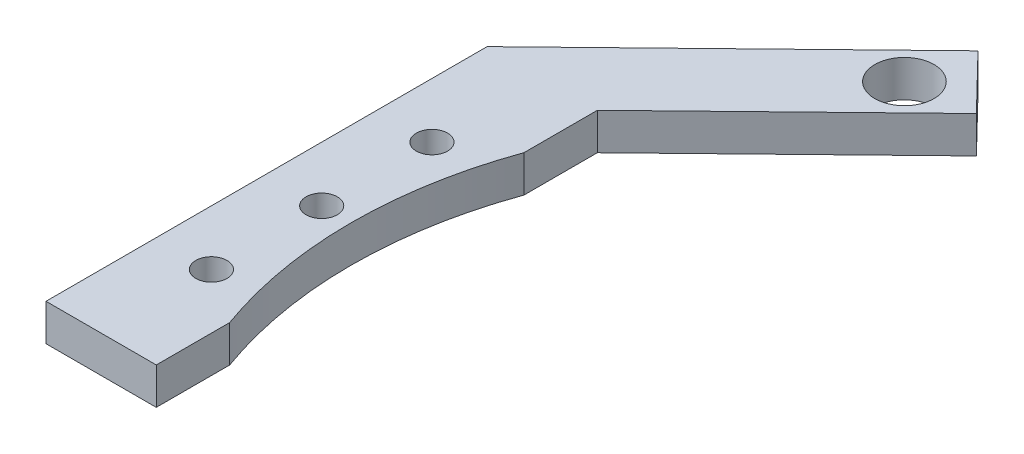
ISO-10303-21;
HEADER;
FILE_DESCRIPTION(('STEP AP214'),'2;1');
FILE_NAME('part.step','',(''),(''),'','','');
FILE_SCHEMA(('AUTOMOTIVE_DESIGN { 1 0 10303 214 1 1 1 1 }'));
ENDSEC;
DATA;
#1=APPLICATION_CONTEXT('core data for automotive mechanical design processes');
#2=APPLICATION_PROTOCOL_DEFINITION('international standard','automotive_design',2000,#1);
#3=PRODUCT_CONTEXT('',#1,'mechanical');
#4=PRODUCT('Part','Part','',(#3));
#5=PRODUCT_RELATED_PRODUCT_CATEGORY('part','',(#4));
#6=PRODUCT_DEFINITION_FORMATION('','',#4);
#7=PRODUCT_DEFINITION_CONTEXT('part definition',#1,'design');
#8=PRODUCT_DEFINITION('design','',#6,#7);
#9=PRODUCT_DEFINITION_SHAPE('','',#8);
#10=(LENGTH_UNIT() NAMED_UNIT(*) SI_UNIT(.MILLI.,.METRE.));
#11=(NAMED_UNIT(*) PLANE_ANGLE_UNIT() SI_UNIT($,.RADIAN.));
#12=(NAMED_UNIT(*) SI_UNIT($,.STERADIAN.) SOLID_ANGLE_UNIT());
#13=UNCERTAINTY_MEASURE_WITH_UNIT(LENGTH_MEASURE(1.E-05),#10,'distance_accuracy_value','');
#14=(GEOMETRIC_REPRESENTATION_CONTEXT(3) GLOBAL_UNCERTAINTY_ASSIGNED_CONTEXT((#13)) GLOBAL_UNIT_ASSIGNED_CONTEXT((#10,
#11,#12)) REPRESENTATION_CONTEXT('',''));
#15=CARTESIAN_POINT('',(0.,0.,0.));
#16=DIRECTION('',(0.,0.,1.));
#17=DIRECTION('',(1.,0.,0.));
#18=AXIS2_PLACEMENT_3D('',#15,#16,#17);
#19=CARTESIAN_POINT('',(-55.5,2.5,-30.));
#20=DIRECTION('',(-1.,0.,0.));
#21=DIRECTION('',(0.,0.,1.));
#22=AXIS2_PLACEMENT_3D('',#19,#20,#21);
#23=PLANE('',#22);
#24=DIRECTION('',(0.,0.,-1.));
#25=VECTOR('',#24,1.);
#26=CARTESIAN_POINT('',(-55.5,-2.5,-30.));
#27=LINE('',#26,#25);
#28=CARTESIAN_POINT('',(-55.5,-2.5,30.));
#29=VERTEX_POINT('',#28);
#30=CARTESIAN_POINT('',(-55.5,-2.5,20.0187412191676));
#31=VERTEX_POINT('',#30);
#32=EDGE_CURVE('E143',#29,#31,#27,.T.);
#33=ORIENTED_EDGE('',*,*,#32,.T.);
#34=DIRECTION('',(0.,1.,0.));
#35=VECTOR('',#34,1.);
#36=CARTESIAN_POINT('',(-55.5,-2.5,20.0187412191676));
#37=LINE('',#36,#35);
#38=CARTESIAN_POINT('',(-55.5,2.5,20.0187412191676));
#39=VERTEX_POINT('',#38);
#40=EDGE_CURVE('E11',#31,#39,#37,.T.);
#41=ORIENTED_EDGE('',*,*,#40,.T.);
#42=DIRECTION('',(0.,0.,-1.));
#43=VECTOR('',#42,1.);
#44=CARTESIAN_POINT('',(-55.5,2.5,-30.));
#45=LINE('',#44,#43);
#46=CARTESIAN_POINT('',(-55.5,2.5,30.));
#47=VERTEX_POINT('',#46);
#48=EDGE_CURVE('E118',#47,#39,#45,.T.);
#49=ORIENTED_EDGE('',*,*,#48,.F.);
#50=DIRECTION('',(0.,-1.,0.));
#51=VECTOR('',#50,1.);
#52=CARTESIAN_POINT('',(-55.5,2.5,30.));
#53=LINE('',#52,#51);
#54=EDGE_CURVE('E154',#47,#29,#53,.T.);
#55=ORIENTED_EDGE('',*,*,#54,.T.);
#56=EDGE_LOOP('',(#33,#41,#49,#55));
#57=FACE_BOUND('',#56,.T.);
#58=ADVANCED_FACE('F35',(#57),#23,.F.);
#59=CARTESIAN_POINT('',(0.,2.5,0.));
#60=DIRECTION('',(0.,-1.,0.));
#61=DIRECTION('',(0.,0.,-1.));
#62=AXIS2_PLACEMENT_3D('',#59,#60,#61);
#63=PLANE('',#62);
#64=ORIENTED_EDGE('',*,*,#48,.T.);
#65=CARTESIAN_POINT('',(0.,2.5,0.));
#66=DIRECTION('',(0.,1.,0.));
#67=DIRECTION('',(0.,0.,1.));
#68=AXIS2_PLACEMENT_3D('',#65,#66,#67);
#69=CIRCLE('',#68,59.);
#70=CARTESIAN_POINT('',(-55.5,2.5,-20.0187412191676));
#71=VERTEX_POINT('',#70);
#72=EDGE_CURVE('E179',#71,#39,#69,.T.);
#73=ORIENTED_EDGE('',*,*,#72,.F.);
#74=CARTESIAN_POINT('',(-55.5,2.5,-30.));
#75=VERTEX_POINT('',#74);
#76=EDGE_CURVE('E114',#71,#75,#45,.T.);
#77=ORIENTED_EDGE('',*,*,#76,.T.);
#78=DIRECTION('',(0.717529446727856,0.,-0.696528171058728));
#79=VECTOR('',#78,1.);
#80=CARTESIAN_POINT('',(-29.3380965830736,2.5,-55.3961740824809));
#81=LINE('',#80,#79);
#82=CARTESIAN_POINT('',(-29.3380965830736,2.5,-55.3961740824809));
#83=VERTEX_POINT('',#82);
#84=EDGE_CURVE('E104',#75,#83,#81,.T.);
#85=ORIENTED_EDGE('',*,*,#84,.T.);
#86=DIRECTION('',(-0.696528171058728,0.,-0.717529446727856));
#87=VECTOR('',#86,1.);
#88=CARTESIAN_POINT('',(-36.6153689792499,2.5,-62.8928661806329));
#89=LINE('',#88,#87);
#90=CARTESIAN_POINT('',(-36.6153689792499,2.5,-62.8928661806329));
#91=VERTEX_POINT('',#90);
#92=EDGE_CURVE('E110',#83,#91,#89,.T.);
#93=ORIENTED_EDGE('',*,*,#92,.T.);
#94=DIRECTION('',(-0.717529446727856,0.,0.696528171058728));
#95=VECTOR('',#94,1.);
#96=CARTESIAN_POINT('',(-70.5,2.5,-30.));
#97=LINE('',#96,#95);
#98=CARTESIAN_POINT('',(-70.5,2.5,-30.));
#99=VERTEX_POINT('',#98);
#100=EDGE_CURVE('E59',#91,#99,#97,.T.);
#101=ORIENTED_EDGE('',*,*,#100,.T.);
#102=DIRECTION('',(0.,0.,1.));
#103=VECTOR('',#102,1.);
#104=CARTESIAN_POINT('',(-70.5,2.5,-30.));
#105=LINE('',#104,#103);
#106=CARTESIAN_POINT('',(-70.5,2.5,30.));
#107=VERTEX_POINT('',#106);
#108=EDGE_CURVE('E150',#99,#107,#105,.T.);
#109=ORIENTED_EDGE('',*,*,#108,.T.);
#110=DIRECTION('',(1.,0.,0.));
#111=VECTOR('',#110,1.);
#112=CARTESIAN_POINT('',(-55.5,2.5,30.));
#113=LINE('',#112,#111);
#114=EDGE_CURVE('E95',#107,#47,#113,.T.);
#115=ORIENTED_EDGE('',*,*,#114,.T.);
#116=EDGE_LOOP('',(#64,#73,#77,#85,#93,#101,#109,#115));
#117=FACE_BOUND('',#116,.T.);
#118=CARTESIAN_POINT('',(-63.,2.5,0.));
#119=DIRECTION('',(0.,1.,0.));
#120=DIRECTION('',(0.,0.,1.));
#121=AXIS2_PLACEMENT_3D('',#118,#119,#120);
#122=CIRCLE('',#121,2.125);
#123=CARTESIAN_POINT('',(-63.,2.5,2.12500000000001));
#124=VERTEX_POINT('',#123);
#125=EDGE_CURVE('E140',#124,#124,#122,.T.);
#126=ORIENTED_EDGE('',*,*,#125,.F.);
#127=EDGE_LOOP('',(#126));
#128=FACE_BOUND('',#127,.T.);
#129=CARTESIAN_POINT('',(-63.,2.5,15.));
#130=DIRECTION('',(0.,1.,0.));
#131=DIRECTION('',(0.,0.,1.));
#132=AXIS2_PLACEMENT_3D('',#129,#130,#131);
#133=CIRCLE('',#132,2.125);
#134=CARTESIAN_POINT('',(-63.,2.5,17.125));
#135=VERTEX_POINT('',#134);
#136=EDGE_CURVE('E198',#135,#135,#133,.T.);
#137=ORIENTED_EDGE('',*,*,#136,.F.);
#138=EDGE_LOOP('',(#137));
#139=FACE_BOUND('',#138,.T.);
#140=CARTESIAN_POINT('',(-37.9994389082567,2.5,-54.2688229341458));
#141=DIRECTION('',(0.,1.,0.));
#142=DIRECTION('',(0.,0.,1.));
#143=AXIS2_PLACEMENT_3D('',#140,#141,#142);
#144=CIRCLE('',#143,4.025);
#145=CARTESIAN_POINT('',(-37.9994389082567,2.5,-50.2438229341458));
#146=VERTEX_POINT('',#145);
#147=EDGE_CURVE('E192',#146,#146,#144,.T.);
#148=ORIENTED_EDGE('',*,*,#147,.F.);
#149=EDGE_LOOP('',(#148));
#150=FACE_BOUND('',#149,.T.);
#151=CARTESIAN_POINT('',(-63.,2.5,-15.));
#152=DIRECTION('',(0.,1.,0.));
#153=DIRECTION('',(0.,0.,1.));
#154=AXIS2_PLACEMENT_3D('',#151,#152,#153);
#155=CIRCLE('',#154,2.125);
#156=CARTESIAN_POINT('',(-63.,2.5,-12.875));
#157=VERTEX_POINT('',#156);
#158=EDGE_CURVE('E186',#157,#157,#155,.T.);
#159=ORIENTED_EDGE('',*,*,#158,.F.);
#160=EDGE_LOOP('',(#159));
#161=FACE_BOUND('',#160,.T.);
#162=ADVANCED_FACE('F107',(#117,#128,#139,#150,#161),#63,.F.);
#163=CARTESIAN_POINT('',(0.,-2.5,0.));
#164=DIRECTION('',(0.,-1.,0.));
#165=DIRECTION('',(0.,0.,-1.));
#166=AXIS2_PLACEMENT_3D('',#163,#164,#165);
#167=PLANE('',#166);
#168=CARTESIAN_POINT('',(0.,-2.5,0.));
#169=DIRECTION('',(0.,1.,0.));
#170=DIRECTION('',(0.,0.,1.));
#171=AXIS2_PLACEMENT_3D('',#168,#169,#170);
#172=CIRCLE('',#171,59.);
#173=CARTESIAN_POINT('',(-55.5,-2.5,-20.0187412191676));
#174=VERTEX_POINT('',#173);
#175=EDGE_CURVE('E50',#174,#31,#172,.T.);
#176=ORIENTED_EDGE('',*,*,#175,.T.);
#177=ORIENTED_EDGE('',*,*,#32,.F.);
#178=DIRECTION('',(1.,0.,0.));
#179=VECTOR('',#178,1.);
#180=CARTESIAN_POINT('',(-55.5,-2.5,30.));
#181=LINE('',#180,#179);
#182=CARTESIAN_POINT('',(-70.5,-2.5,30.));
#183=VERTEX_POINT('',#182);
#184=EDGE_CURVE('E139',#183,#29,#181,.T.);
#185=ORIENTED_EDGE('',*,*,#184,.F.);
#186=DIRECTION('',(0.,0.,1.));
#187=VECTOR('',#186,1.);
#188=CARTESIAN_POINT('',(-70.5,-2.5,-30.));
#189=LINE('',#188,#187);
#190=CARTESIAN_POINT('',(-70.5,-2.5,-30.));
#191=VERTEX_POINT('',#190);
#192=EDGE_CURVE('E136',#191,#183,#189,.T.);
#193=ORIENTED_EDGE('',*,*,#192,.F.);
#194=DIRECTION('',(-0.717529446727856,0.,0.696528171058728));
#195=VECTOR('',#194,1.);
#196=CARTESIAN_POINT('',(-70.5,-2.5,-30.));
#197=LINE('',#196,#195);
#198=CARTESIAN_POINT('',(-36.6153689792499,-2.5,-62.8928661806329));
#199=VERTEX_POINT('',#198);
#200=EDGE_CURVE('E86',#199,#191,#197,.T.);
#201=ORIENTED_EDGE('',*,*,#200,.F.);
#202=DIRECTION('',(-0.696528171058728,0.,-0.717529446727856));
#203=VECTOR('',#202,1.);
#204=CARTESIAN_POINT('',(-36.6153689792499,-2.5,-62.8928661806329));
#205=LINE('',#204,#203);
#206=CARTESIAN_POINT('',(-29.3380965830736,-2.5,-55.3961740824809));
#207=VERTEX_POINT('',#206);
#208=EDGE_CURVE('E147',#207,#199,#205,.T.);
#209=ORIENTED_EDGE('',*,*,#208,.F.);
#210=DIRECTION('',(0.717529446727856,0.,-0.696528171058728));
#211=VECTOR('',#210,1.);
#212=CARTESIAN_POINT('',(-29.3380965830736,-2.5,-55.3961740824809));
#213=LINE('',#212,#211);
#214=CARTESIAN_POINT('',(-55.5,-2.5,-30.));
#215=VERTEX_POINT('',#214);
#216=EDGE_CURVE('E124',#215,#207,#213,.T.);
#217=ORIENTED_EDGE('',*,*,#216,.F.);
#218=EDGE_CURVE('E142',#174,#215,#27,.T.);
#219=ORIENTED_EDGE('',*,*,#218,.F.);
#220=EDGE_LOOP('',(#176,#177,#185,#193,#201,#209,#217,#219));
#221=FACE_BOUND('',#220,.T.);
#222=CARTESIAN_POINT('',(-37.9994389082567,-2.5,-54.2688229341458));
#223=DIRECTION('',(0.,1.,0.));
#224=DIRECTION('',(0.,0.,1.));
#225=AXIS2_PLACEMENT_3D('',#222,#223,#224);
#226=CIRCLE('',#225,4.025);
#227=CARTESIAN_POINT('',(-37.9994389082567,-2.5,-50.2438229341458));
#228=VERTEX_POINT('',#227);
#229=EDGE_CURVE('E189',#228,#228,#226,.T.);
#230=ORIENTED_EDGE('',*,*,#229,.T.);
#231=EDGE_LOOP('',(#230));
#232=FACE_BOUND('',#231,.T.);
#233=CARTESIAN_POINT('',(-63.,-2.5,0.));
#234=DIRECTION('',(0.,1.,0.));
#235=DIRECTION('',(0.,0.,1.));
#236=AXIS2_PLACEMENT_3D('',#233,#234,#235);
#237=CIRCLE('',#236,2.125);
#238=CARTESIAN_POINT('',(-63.,-2.5,2.12500000000001));
#239=VERTEX_POINT('',#238);
#240=EDGE_CURVE('E175',#239,#239,#237,.T.);
#241=ORIENTED_EDGE('',*,*,#240,.T.);
#242=EDGE_LOOP('',(#241));
#243=FACE_BOUND('',#242,.T.);
#244=CARTESIAN_POINT('',(-63.,-2.5,15.));
#245=DIRECTION('',(0.,1.,0.));
#246=DIRECTION('',(0.,0.,1.));
#247=AXIS2_PLACEMENT_3D('',#244,#245,#246);
#248=CIRCLE('',#247,2.125);
#249=CARTESIAN_POINT('',(-63.,-2.5,17.125));
#250=VERTEX_POINT('',#249);
#251=EDGE_CURVE('E195',#250,#250,#248,.T.);
#252=ORIENTED_EDGE('',*,*,#251,.T.);
#253=EDGE_LOOP('',(#252));
#254=FACE_BOUND('',#253,.T.);
#255=CARTESIAN_POINT('',(-63.,-2.5,-15.));
#256=DIRECTION('',(0.,1.,0.));
#257=DIRECTION('',(0.,0.,1.));
#258=AXIS2_PLACEMENT_3D('',#255,#256,#257);
#259=CIRCLE('',#258,2.125);
#260=CARTESIAN_POINT('',(-63.,-2.5,-12.875));
#261=VERTEX_POINT('',#260);
#262=EDGE_CURVE('E183',#261,#261,#259,.T.);
#263=ORIENTED_EDGE('',*,*,#262,.T.);
#264=EDGE_LOOP('',(#263));
#265=FACE_BOUND('',#264,.T.);
#266=ADVANCED_FACE('F164',(#221,#232,#243,#254,#265),#167,.T.);
#267=CARTESIAN_POINT('',(-70.5,2.5,-30.));
#268=DIRECTION('',(1.,0.,0.));
#269=DIRECTION('',(0.,0.,-1.));
#270=AXIS2_PLACEMENT_3D('',#267,#268,#269);
#271=PLANE('',#270);
#272=ORIENTED_EDGE('',*,*,#192,.T.);
#273=DIRECTION('',(0.,-1.,0.));
#274=VECTOR('',#273,1.);
#275=CARTESIAN_POINT('',(-70.5,2.5,30.));
#276=LINE('',#275,#274);
#277=EDGE_CURVE('E157',#107,#183,#276,.T.);
#278=ORIENTED_EDGE('',*,*,#277,.F.);
#279=ORIENTED_EDGE('',*,*,#108,.F.);
#280=DIRECTION('',(0.,-1.,0.));
#281=VECTOR('',#280,1.);
#282=CARTESIAN_POINT('',(-70.5,2.5,-30.));
#283=LINE('',#282,#281);
#284=EDGE_CURVE('E132',#99,#191,#283,.T.);
#285=ORIENTED_EDGE('',*,*,#284,.T.);
#286=EDGE_LOOP('',(#272,#278,#279,#285));
#287=FACE_BOUND('',#286,.T.);
#288=ADVANCED_FACE('F37',(#287),#271,.F.);
#289=CARTESIAN_POINT('',(-55.5,2.5,30.));
#290=DIRECTION('',(0.,0.,-1.));
#291=DIRECTION('',(-1.,0.,0.));
#292=AXIS2_PLACEMENT_3D('',#289,#290,#291);
#293=PLANE('',#292);
#294=ORIENTED_EDGE('',*,*,#184,.T.);
#295=ORIENTED_EDGE('',*,*,#54,.F.);
#296=ORIENTED_EDGE('',*,*,#114,.F.);
#297=ORIENTED_EDGE('',*,*,#277,.T.);
#298=EDGE_LOOP('',(#294,#295,#296,#297));
#299=FACE_BOUND('',#298,.T.);
#300=ADVANCED_FACE('F230',(#299),#293,.F.);
#301=ORIENTED_EDGE('',*,*,#76,.F.);
#302=DIRECTION('',(0.,1.,0.));
#303=VECTOR('',#302,1.);
#304=CARTESIAN_POINT('',(-55.5,-2.5,-20.0187412191676));
#305=LINE('',#304,#303);
#306=EDGE_CURVE('E43',#71,#174,#305,.F.);
#307=ORIENTED_EDGE('',*,*,#306,.T.);
#308=ORIENTED_EDGE('',*,*,#218,.T.);
#309=DIRECTION('',(0.,-1.,0.));
#310=VECTOR('',#309,1.);
#311=CARTESIAN_POINT('',(-55.5,2.5,-30.));
#312=LINE('',#311,#310);
#313=EDGE_CURVE('E127',#75,#215,#312,.T.);
#314=ORIENTED_EDGE('',*,*,#313,.F.);
#315=EDGE_LOOP('',(#301,#307,#308,#314));
#316=FACE_BOUND('',#315,.T.);
#317=ADVANCED_FACE('F160',(#316),#23,.F.);
#318=CARTESIAN_POINT('',(-29.3380965830736,2.5,-55.3961740824809));
#319=DIRECTION('',(-0.696528171058728,0.,-0.717529446727856));
#320=DIRECTION('',(-0.717529446727856,0.,0.696528171058728));
#321=AXIS2_PLACEMENT_3D('',#318,#319,#320);
#322=PLANE('',#321);
#323=ORIENTED_EDGE('',*,*,#216,.T.);
#324=DIRECTION('',(0.,-1.,0.));
#325=VECTOR('',#324,1.);
#326=CARTESIAN_POINT('',(-29.3380965830736,2.5,-55.3961740824809));
#327=LINE('',#326,#325);
#328=EDGE_CURVE('E121',#83,#207,#327,.T.);
#329=ORIENTED_EDGE('',*,*,#328,.F.);
#330=ORIENTED_EDGE('',*,*,#84,.F.);
#331=ORIENTED_EDGE('',*,*,#313,.T.);
#332=EDGE_LOOP('',(#323,#329,#330,#331));
#333=FACE_BOUND('',#332,.T.);
#334=ADVANCED_FACE('F122',(#333),#322,.F.);
#335=CARTESIAN_POINT('',(-36.6153689792499,2.5,-62.8928661806329));
#336=DIRECTION('',(-0.717529446727856,0.,0.696528171058728));
#337=DIRECTION('',(0.696528171058728,0.,0.717529446727856));
#338=AXIS2_PLACEMENT_3D('',#335,#336,#337);
#339=PLANE('',#338);
#340=ORIENTED_EDGE('',*,*,#208,.T.);
#341=DIRECTION('',(0.,-1.,0.));
#342=VECTOR('',#341,1.);
#343=CARTESIAN_POINT('',(-36.6153689792499,2.5,-62.8928661806329));
#344=LINE('',#343,#342);
#345=EDGE_CURVE('E128',#91,#199,#344,.T.);
#346=ORIENTED_EDGE('',*,*,#345,.F.);
#347=ORIENTED_EDGE('',*,*,#92,.F.);
#348=ORIENTED_EDGE('',*,*,#328,.T.);
#349=EDGE_LOOP('',(#340,#346,#347,#348));
#350=FACE_BOUND('',#349,.T.);
#351=ADVANCED_FACE('F130',(#350),#339,.F.);
#352=CARTESIAN_POINT('',(-70.5,2.5,-30.));
#353=DIRECTION('',(0.696528171058728,0.,0.717529446727856));
#354=DIRECTION('',(0.717529446727856,0.,-0.696528171058728));
#355=AXIS2_PLACEMENT_3D('',#352,#353,#354);
#356=PLANE('',#355);
#357=ORIENTED_EDGE('',*,*,#200,.T.);
#358=ORIENTED_EDGE('',*,*,#284,.F.);
#359=ORIENTED_EDGE('',*,*,#100,.F.);
#360=ORIENTED_EDGE('',*,*,#345,.T.);
#361=EDGE_LOOP('',(#357,#358,#359,#360));
#362=FACE_BOUND('',#361,.T.);
#363=ADVANCED_FACE('F168',(#362),#356,.F.);
#364=CARTESIAN_POINT('',(-63.,2.5,0.));
#365=DIRECTION('',(0.,-1.,0.));
#366=DIRECTION('',(0.,0.,-1.));
#367=AXIS2_PLACEMENT_3D('',#364,#365,#366);
#368=CYLINDRICAL_SURFACE('',#367,2.125);
#369=ORIENTED_EDGE('',*,*,#125,.T.);
#370=EDGE_LOOP('',(#369));
#371=FACE_BOUND('',#370,.T.);
#372=ORIENTED_EDGE('',*,*,#240,.F.);
#373=EDGE_LOOP('',(#372));
#374=FACE_BOUND('',#373,.T.);
#375=ADVANCED_FACE('F210',(#371,#374),#368,.F.);
#376=CARTESIAN_POINT('',(-63.,2.5,15.));
#377=DIRECTION('',(0.,-1.,0.));
#378=DIRECTION('',(0.,0.,-1.));
#379=AXIS2_PLACEMENT_3D('',#376,#377,#378);
#380=CYLINDRICAL_SURFACE('',#379,2.125);
#381=ORIENTED_EDGE('',*,*,#136,.T.);
#382=EDGE_LOOP('',(#381));
#383=FACE_BOUND('',#382,.T.);
#384=ORIENTED_EDGE('',*,*,#251,.F.);
#385=EDGE_LOOP('',(#384));
#386=FACE_BOUND('',#385,.T.);
#387=ADVANCED_FACE('F212',(#383,#386),#380,.F.);
#388=CARTESIAN_POINT('',(-37.9994389082567,2.5,-54.2688229341458));
#389=DIRECTION('',(0.,-1.,0.));
#390=DIRECTION('',(0.,0.,-1.));
#391=AXIS2_PLACEMENT_3D('',#388,#389,#390);
#392=CYLINDRICAL_SURFACE('',#391,4.025);
#393=ORIENTED_EDGE('',*,*,#147,.T.);
#394=EDGE_LOOP('',(#393));
#395=FACE_BOUND('',#394,.T.);
#396=ORIENTED_EDGE('',*,*,#229,.F.);
#397=EDGE_LOOP('',(#396));
#398=FACE_BOUND('',#397,.T.);
#399=ADVANCED_FACE('F218',(#395,#398),#392,.F.);
#400=CARTESIAN_POINT('',(-63.,2.5,-15.));
#401=DIRECTION('',(0.,-1.,0.));
#402=DIRECTION('',(0.,0.,-1.));
#403=AXIS2_PLACEMENT_3D('',#400,#401,#402);
#404=CYLINDRICAL_SURFACE('',#403,2.125);
#405=ORIENTED_EDGE('',*,*,#158,.T.);
#406=EDGE_LOOP('',(#405));
#407=FACE_BOUND('',#406,.T.);
#408=ORIENTED_EDGE('',*,*,#262,.F.);
#409=EDGE_LOOP('',(#408));
#410=FACE_BOUND('',#409,.T.);
#411=ADVANCED_FACE('F273',(#407,#410),#404,.F.);
#412=CARTESIAN_POINT('',(0.,-2.5,0.));
#413=DIRECTION('',(0.,1.,0.));
#414=DIRECTION('',(0.,0.,1.));
#415=AXIS2_PLACEMENT_3D('',#412,#413,#414);
#416=CYLINDRICAL_SURFACE('',#415,59.);
#417=ORIENTED_EDGE('',*,*,#175,.F.);
#418=ORIENTED_EDGE('',*,*,#306,.F.);
#419=ORIENTED_EDGE('',*,*,#72,.T.);
#420=ORIENTED_EDGE('',*,*,#40,.F.);
#421=EDGE_LOOP('',(#417,#418,#419,#420));
#422=FACE_BOUND('',#421,.T.);
#423=ADVANCED_FACE('F181',(#422),#416,.F.);
#424=CLOSED_SHELL('',(#58,#162,#266,#288,#300,#317,#334,#351,#363,#375,#387,#399,#411,#423));
#425=MANIFOLD_SOLID_BREP('B2',#424);
#426=ADVANCED_BREP_SHAPE_REPRESENTATION('',(#18,#425),#14);
#427=SHAPE_DEFINITION_REPRESENTATION(#9,#426);
ENDSEC;
END-ISO-10303-21;
